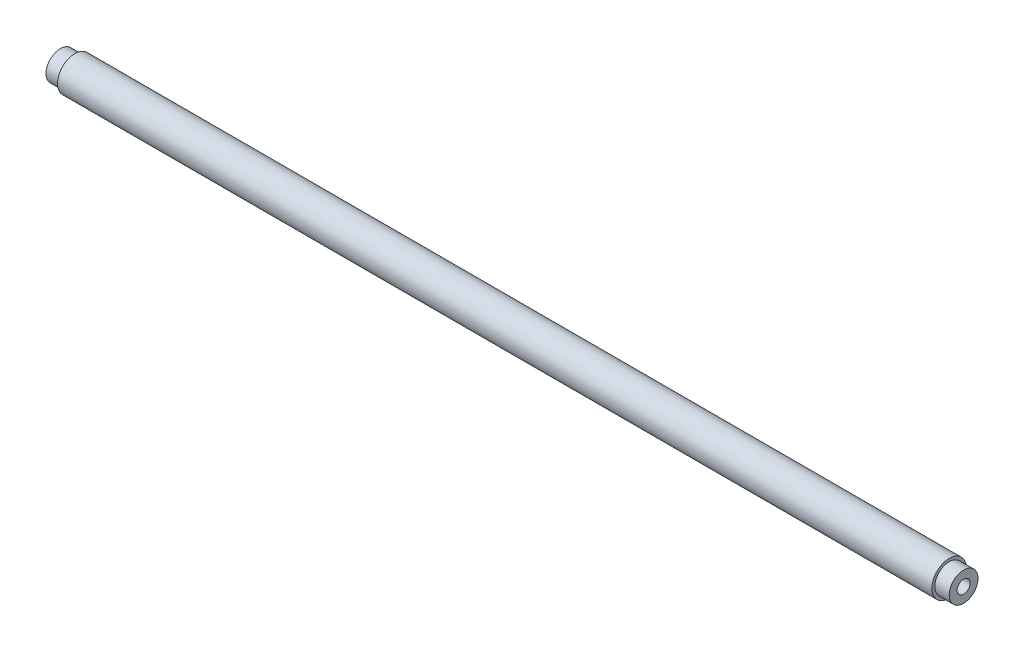
ISO-10303-21;
HEADER;
FILE_DESCRIPTION(('STEP AP214'),'2;1');
FILE_NAME('part.step','',(''),(''),'','','');
FILE_SCHEMA(('AUTOMOTIVE_DESIGN { 1 0 10303 214 1 1 1 1 }'));
ENDSEC;
DATA;
#1=APPLICATION_CONTEXT('core data for automotive mechanical design processes');
#2=APPLICATION_PROTOCOL_DEFINITION('international standard','automotive_design',2000,#1);
#3=PRODUCT_CONTEXT('',#1,'mechanical');
#4=PRODUCT('Part','Part','',(#3));
#5=PRODUCT_RELATED_PRODUCT_CATEGORY('part','',(#4));
#6=PRODUCT_DEFINITION_FORMATION('','',#4);
#7=PRODUCT_DEFINITION_CONTEXT('part definition',#1,'design');
#8=PRODUCT_DEFINITION('design','',#6,#7);
#9=PRODUCT_DEFINITION_SHAPE('','',#8);
#10=(LENGTH_UNIT() NAMED_UNIT(*) SI_UNIT(.MILLI.,.METRE.));
#11=(NAMED_UNIT(*) PLANE_ANGLE_UNIT() SI_UNIT($,.RADIAN.));
#12=(NAMED_UNIT(*) SI_UNIT($,.STERADIAN.) SOLID_ANGLE_UNIT());
#13=UNCERTAINTY_MEASURE_WITH_UNIT(LENGTH_MEASURE(1.E-05),#10,'distance_accuracy_value','');
#14=(GEOMETRIC_REPRESENTATION_CONTEXT(3) GLOBAL_UNCERTAINTY_ASSIGNED_CONTEXT((#13)) GLOBAL_UNIT_ASSIGNED_CONTEXT((#10,
#11,#12)) REPRESENTATION_CONTEXT('',''));
#15=CARTESIAN_POINT('',(0.,0.,0.));
#16=DIRECTION('',(0.,0.,1.));
#17=DIRECTION('',(1.,0.,0.));
#18=AXIS2_PLACEMENT_3D('',#15,#16,#17);
#19=CARTESIAN_POINT('',(-227.5,7.5,0.));
#20=DIRECTION('',(1.,0.,0.));
#21=DIRECTION('',(0.,0.,-1.));
#22=AXIS2_PLACEMENT_3D('',#19,#20,#21);
#23=PLANE('',#22);
#24=CARTESIAN_POINT('',(-227.5,0.,0.));
#25=DIRECTION('',(-1.,0.,0.));
#26=DIRECTION('',(0.,0.,1.));
#27=AXIS2_PLACEMENT_3D('',#24,#25,#26);
#28=CIRCLE('',#27,7.5);
#29=CARTESIAN_POINT('',(-227.5,0.,7.5));
#30=VERTEX_POINT('',#29);
#31=EDGE_CURVE('E74',#30,#30,#28,.T.);
#32=ORIENTED_EDGE('',*,*,#31,.F.);
#33=EDGE_LOOP('',(#32));
#34=FACE_BOUND('',#33,.T.);
#35=CARTESIAN_POINT('',(-227.5,0.,0.));
#36=DIRECTION('',(-1.,0.,0.));
#37=DIRECTION('',(0.,0.,1.));
#38=AXIS2_PLACEMENT_3D('',#35,#36,#37);
#39=CIRCLE('',#38,9.);
#40=CARTESIAN_POINT('',(-227.5,0.,9.));
#41=VERTEX_POINT('',#40);
#42=EDGE_CURVE('E11',#41,#41,#39,.T.);
#43=ORIENTED_EDGE('',*,*,#42,.T.);
#44=EDGE_LOOP('',(#43));
#45=FACE_BOUND('',#44,.T.);
#46=ADVANCED_FACE('F40',(#34,#45),#23,.F.);
#47=CARTESIAN_POINT('',(-235.,0.,0.));
#48=DIRECTION('',(-1.,0.,0.));
#49=DIRECTION('',(0.,0.,1.));
#50=AXIS2_PLACEMENT_3D('',#47,#48,#49);
#51=CYLINDRICAL_SURFACE('',#50,9.00000000000004);
#52=ORIENTED_EDGE('',*,*,#42,.F.);
#53=EDGE_LOOP('',(#52));
#54=FACE_BOUND('',#53,.T.);
#55=CARTESIAN_POINT('',(227.5,0.,0.));
#56=DIRECTION('',(-1.,0.,0.));
#57=DIRECTION('',(0.,0.,1.));
#58=AXIS2_PLACEMENT_3D('',#55,#56,#57);
#59=CIRCLE('',#58,9.00000000000008);
#60=CARTESIAN_POINT('',(227.5,0.,9.00000000000008));
#61=VERTEX_POINT('',#60);
#62=EDGE_CURVE('E47',#61,#61,#59,.T.);
#63=ORIENTED_EDGE('',*,*,#62,.T.);
#64=EDGE_LOOP('',(#63));
#65=FACE_BOUND('',#64,.T.);
#66=ADVANCED_FACE('F88',(#54,#65),#51,.T.);
#67=CARTESIAN_POINT('',(227.5,9.00000000000008,0.));
#68=DIRECTION('',(-1.,0.,0.));
#69=DIRECTION('',(0.,0.,1.));
#70=AXIS2_PLACEMENT_3D('',#67,#68,#69);
#71=PLANE('',#70);
#72=ORIENTED_EDGE('',*,*,#62,.F.);
#73=EDGE_LOOP('',(#72));
#74=FACE_BOUND('',#73,.T.);
#75=CARTESIAN_POINT('',(227.5,0.,0.));
#76=DIRECTION('',(-1.,0.,0.));
#77=DIRECTION('',(0.,0.,1.));
#78=AXIS2_PLACEMENT_3D('',#75,#76,#77);
#79=CIRCLE('',#78,7.50000000000008);
#80=CARTESIAN_POINT('',(227.5,0.,7.50000000000008));
#81=VERTEX_POINT('',#80);
#82=EDGE_CURVE('E83',#81,#81,#79,.T.);
#83=ORIENTED_EDGE('',*,*,#82,.T.);
#84=EDGE_LOOP('',(#83));
#85=FACE_BOUND('',#84,.T.);
#86=ADVANCED_FACE('F90',(#74,#85),#71,.F.);
#87=CARTESIAN_POINT('',(-235.,0.,0.));
#88=DIRECTION('',(-1.,0.,0.));
#89=DIRECTION('',(0.,0.,1.));
#90=AXIS2_PLACEMENT_3D('',#87,#88,#89);
#91=CYLINDRICAL_SURFACE('',#90,7.50000000000008);
#92=ORIENTED_EDGE('',*,*,#82,.F.);
#93=EDGE_LOOP('',(#92));
#94=FACE_BOUND('',#93,.T.);
#95=CARTESIAN_POINT('',(235.,0.,0.));
#96=DIRECTION('',(-1.,0.,0.));
#97=DIRECTION('',(0.,0.,1.));
#98=AXIS2_PLACEMENT_3D('',#95,#96,#97);
#99=CIRCLE('',#98,7.50000000000009);
#100=CARTESIAN_POINT('',(235.,0.,7.50000000000009));
#101=VERTEX_POINT('',#100);
#102=EDGE_CURVE('E80',#101,#101,#99,.T.);
#103=ORIENTED_EDGE('',*,*,#102,.T.);
#104=EDGE_LOOP('',(#103));
#105=FACE_BOUND('',#104,.T.);
#106=ADVANCED_FACE('F93',(#94,#105),#91,.T.);
#107=CARTESIAN_POINT('',(235.,7.50000000000009,0.));
#108=DIRECTION('',(-1.,0.,0.));
#109=DIRECTION('',(0.,0.,1.));
#110=AXIS2_PLACEMENT_3D('',#107,#108,#109);
#111=PLANE('',#110);
#112=CARTESIAN_POINT('',(235.,0.,0.));
#113=DIRECTION('',(1.,0.,0.));
#114=DIRECTION('',(0.,0.,-1.));
#115=AXIS2_PLACEMENT_3D('',#112,#113,#114);
#116=CIRCLE('',#115,3.4);
#117=CARTESIAN_POINT('',(235.,0.,-3.4));
#118=VERTEX_POINT('',#117);
#119=EDGE_CURVE('E63',#118,#118,#116,.T.);
#120=ORIENTED_EDGE('',*,*,#119,.F.);
#121=EDGE_LOOP('',(#120));
#122=FACE_BOUND('',#121,.T.);
#123=ORIENTED_EDGE('',*,*,#102,.F.);
#124=EDGE_LOOP('',(#123));
#125=FACE_BOUND('',#124,.T.);
#126=ADVANCED_FACE('F99',(#122,#125),#111,.F.);
#127=CARTESIAN_POINT('',(-235.,0.,0.));
#128=DIRECTION('',(1.,0.,0.));
#129=DIRECTION('',(0.,0.,-1.));
#130=AXIS2_PLACEMENT_3D('',#127,#128,#129);
#131=PLANE('',#130);
#132=CARTESIAN_POINT('',(-235.,0.,0.));
#133=DIRECTION('',(-1.,0.,0.));
#134=DIRECTION('',(0.,0.,1.));
#135=AXIS2_PLACEMENT_3D('',#132,#133,#134);
#136=CIRCLE('',#135,3.4);
#137=CARTESIAN_POINT('',(-235.,0.,3.4));
#138=VERTEX_POINT('',#137);
#139=EDGE_CURVE('E64',#138,#138,#136,.T.);
#140=ORIENTED_EDGE('',*,*,#139,.F.);
#141=EDGE_LOOP('',(#140));
#142=FACE_BOUND('',#141,.T.);
#143=CARTESIAN_POINT('',(-235.,0.,0.));
#144=DIRECTION('',(-1.,0.,0.));
#145=DIRECTION('',(0.,0.,1.));
#146=AXIS2_PLACEMENT_3D('',#143,#144,#145);
#147=CIRCLE('',#146,7.5);
#148=CARTESIAN_POINT('',(-235.,0.,7.5));
#149=VERTEX_POINT('',#148);
#150=EDGE_CURVE('E77',#149,#149,#147,.T.);
#151=ORIENTED_EDGE('',*,*,#150,.T.);
#152=EDGE_LOOP('',(#151));
#153=FACE_BOUND('',#152,.T.);
#154=ADVANCED_FACE('F104',(#142,#153),#131,.F.);
#155=CARTESIAN_POINT('',(-235.,0.,0.));
#156=DIRECTION('',(-1.,0.,0.));
#157=DIRECTION('',(0.,0.,1.));
#158=AXIS2_PLACEMENT_3D('',#155,#156,#157);
#159=CYLINDRICAL_SURFACE('',#158,7.5);
#160=ORIENTED_EDGE('',*,*,#150,.F.);
#161=EDGE_LOOP('',(#160));
#162=FACE_BOUND('',#161,.T.);
#163=ORIENTED_EDGE('',*,*,#31,.T.);
#164=EDGE_LOOP('',(#163));
#165=FACE_BOUND('',#164,.T.);
#166=ADVANCED_FACE('F110',(#162,#165),#159,.T.);
#167=CARTESIAN_POINT('',(215.,0.,0.));
#168=DIRECTION('',(1.,0.,0.));
#169=DIRECTION('',(0.,0.,-1.));
#170=AXIS2_PLACEMENT_3D('',#167,#168,#169);
#171=CONICAL_SURFACE('',#170,3.4,1.02974425867665);
#172=CARTESIAN_POINT('',(212.957073895306,0.,0.));
#173=VERTEX_POINT('',#172);
#174=VERTEX_LOOP('',#173);
#175=FACE_BOUND('',#174,.T.);
#176=CARTESIAN_POINT('',(215.,0.,0.));
#177=DIRECTION('',(1.,0.,0.));
#178=DIRECTION('',(0.,0.,-1.));
#179=AXIS2_PLACEMENT_3D('',#176,#177,#178);
#180=CIRCLE('',#179,3.4);
#181=CARTESIAN_POINT('',(215.,0.,-3.4));
#182=VERTEX_POINT('',#181);
#183=EDGE_CURVE('E67',#182,#182,#180,.T.);
#184=ORIENTED_EDGE('',*,*,#183,.T.);
#185=EDGE_LOOP('',(#184));
#186=FACE_BOUND('',#185,.T.);
#187=ADVANCED_FACE('F125',(#175,#186),#171,.F.);
#188=CARTESIAN_POINT('',(235.,0.,0.));
#189=DIRECTION('',(1.,0.,0.));
#190=DIRECTION('',(0.,0.,-1.));
#191=AXIS2_PLACEMENT_3D('',#188,#189,#190);
#192=CYLINDRICAL_SURFACE('',#191,3.4);
#193=ORIENTED_EDGE('',*,*,#183,.F.);
#194=EDGE_LOOP('',(#193));
#195=FACE_BOUND('',#194,.T.);
#196=ORIENTED_EDGE('',*,*,#119,.T.);
#197=EDGE_LOOP('',(#196));
#198=FACE_BOUND('',#197,.T.);
#199=ADVANCED_FACE('F57',(#195,#198),#192,.F.);
#200=CARTESIAN_POINT('',(-215.,0.,0.));
#201=DIRECTION('',(-1.,0.,0.));
#202=DIRECTION('',(0.,0.,1.));
#203=AXIS2_PLACEMENT_3D('',#200,#201,#202);
#204=CONICAL_SURFACE('',#203,3.4,1.02974425867665);
#205=CARTESIAN_POINT('',(-212.957073895306,0.,0.));
#206=VERTEX_POINT('',#205);
#207=VERTEX_LOOP('',#206);
#208=FACE_BOUND('',#207,.T.);
#209=CARTESIAN_POINT('',(-215.,0.,0.));
#210=DIRECTION('',(-1.,0.,0.));
#211=DIRECTION('',(0.,0.,1.));
#212=AXIS2_PLACEMENT_3D('',#209,#210,#211);
#213=CIRCLE('',#212,3.4);
#214=CARTESIAN_POINT('',(-215.,0.,3.4));
#215=VERTEX_POINT('',#214);
#216=EDGE_CURVE('E61',#215,#215,#213,.T.);
#217=ORIENTED_EDGE('',*,*,#216,.T.);
#218=EDGE_LOOP('',(#217));
#219=FACE_BOUND('',#218,.T.);
#220=ADVANCED_FACE('F53',(#208,#219),#204,.F.);
#221=CARTESIAN_POINT('',(-235.,0.,0.));
#222=DIRECTION('',(-1.,0.,0.));
#223=DIRECTION('',(0.,0.,1.));
#224=AXIS2_PLACEMENT_3D('',#221,#222,#223);
#225=CYLINDRICAL_SURFACE('',#224,3.4);
#226=ORIENTED_EDGE('',*,*,#216,.F.);
#227=EDGE_LOOP('',(#226));
#228=FACE_BOUND('',#227,.T.);
#229=ORIENTED_EDGE('',*,*,#139,.T.);
#230=EDGE_LOOP('',(#229));
#231=FACE_BOUND('',#230,.T.);
#232=ADVANCED_FACE('F56',(#228,#231),#225,.F.);
#233=CLOSED_SHELL('',(#46,#66,#86,#106,#126,#154,#166,#187,#199,#220,#232));
#234=MANIFOLD_SOLID_BREP('B2',#233);
#235=ADVANCED_BREP_SHAPE_REPRESENTATION('',(#18,#234),#14);
#236=SHAPE_DEFINITION_REPRESENTATION(#9,#235);
ENDSEC;
END-ISO-10303-21;
